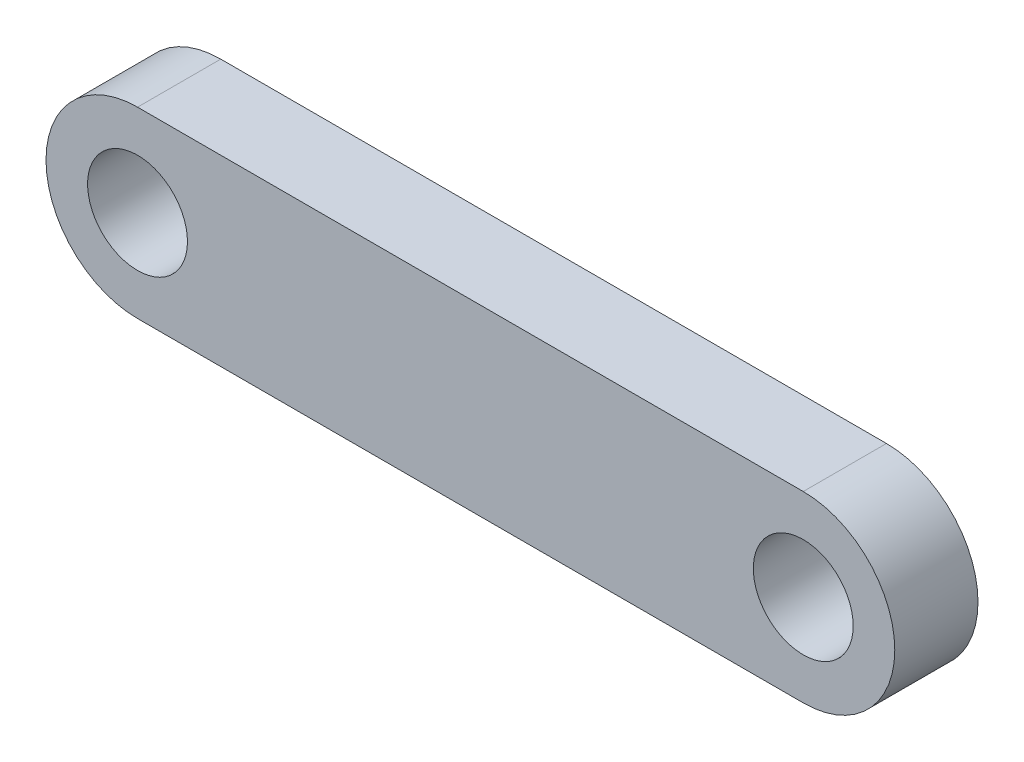
ISO-10303-21;
HEADER;
FILE_DESCRIPTION(('STEP AP214'),'2;1');
FILE_NAME('part.step','',(''),(''),'','','');
FILE_SCHEMA(('AUTOMOTIVE_DESIGN { 1 0 10303 214 1 1 1 1 }'));
ENDSEC;
DATA;
#1=APPLICATION_CONTEXT('core data for automotive mechanical design processes');
#2=APPLICATION_PROTOCOL_DEFINITION('international standard','automotive_design',2000,#1);
#3=PRODUCT_CONTEXT('',#1,'mechanical');
#4=PRODUCT('Part','Part','',(#3));
#5=PRODUCT_RELATED_PRODUCT_CATEGORY('part','',(#4));
#6=PRODUCT_DEFINITION_FORMATION('','',#4);
#7=PRODUCT_DEFINITION_CONTEXT('part definition',#1,'design');
#8=PRODUCT_DEFINITION('design','',#6,#7);
#9=PRODUCT_DEFINITION_SHAPE('','',#8);
#10=(LENGTH_UNIT() NAMED_UNIT(*) SI_UNIT(.MILLI.,.METRE.));
#11=(NAMED_UNIT(*) PLANE_ANGLE_UNIT() SI_UNIT($,.RADIAN.));
#12=(NAMED_UNIT(*) SI_UNIT($,.STERADIAN.) SOLID_ANGLE_UNIT());
#13=UNCERTAINTY_MEASURE_WITH_UNIT(LENGTH_MEASURE(1.E-05),#10,'distance_accuracy_value','');
#14=(GEOMETRIC_REPRESENTATION_CONTEXT(3) GLOBAL_UNCERTAINTY_ASSIGNED_CONTEXT((#13)) GLOBAL_UNIT_ASSIGNED_CONTEXT((#10,
#11,#12)) REPRESENTATION_CONTEXT('',''));
#15=CARTESIAN_POINT('',(0.,0.,0.));
#16=DIRECTION('',(0.,0.,1.));
#17=DIRECTION('',(1.,0.,0.));
#18=AXIS2_PLACEMENT_3D('',#15,#16,#17);
#19=CARTESIAN_POINT('',(-20.,0.,2.5));
#20=DIRECTION('',(0.,0.,1.));
#21=DIRECTION('',(1.,0.,0.));
#22=AXIS2_PLACEMENT_3D('',#19,#20,#21);
#23=PLANE('',#22);
#24=CARTESIAN_POINT('',(-20.,0.,2.5));
#25=DIRECTION('',(0.,0.,1.));
#26=DIRECTION('',(1.,0.,0.));
#27=AXIS2_PLACEMENT_3D('',#24,#25,#26);
#28=CIRCLE('',#27,3.);
#29=CARTESIAN_POINT('',(-17.,0.,2.5));
#30=VERTEX_POINT('',#29);
#31=EDGE_CURVE('E106',#30,#30,#28,.T.);
#32=ORIENTED_EDGE('',*,*,#31,.F.);
#33=EDGE_LOOP('',(#32));
#34=FACE_BOUND('',#33,.T.);
#35=CARTESIAN_POINT('',(-20.,0.,2.5));
#36=DIRECTION('',(0.,0.,1.));
#37=DIRECTION('',(1.,0.,0.));
#38=AXIS2_PLACEMENT_3D('',#35,#36,#37);
#39=CIRCLE('',#38,5.5);
#40=CARTESIAN_POINT('',(-20.,5.5,2.5));
#41=VERTEX_POINT('',#40);
#42=CARTESIAN_POINT('',(-20.,-5.5,2.5));
#43=VERTEX_POINT('',#42);
#44=EDGE_CURVE('E91',#41,#43,#39,.T.);
#45=ORIENTED_EDGE('',*,*,#44,.T.);
#46=DIRECTION('',(1.,0.,0.));
#47=VECTOR('',#46,1.);
#48=CARTESIAN_POINT('',(-20.,-5.5,2.5));
#49=LINE('',#48,#47);
#50=CARTESIAN_POINT('',(20.,-5.5,2.5));
#51=VERTEX_POINT('',#50);
#52=EDGE_CURVE('E86',#43,#51,#49,.T.);
#53=ORIENTED_EDGE('',*,*,#52,.T.);
#54=CARTESIAN_POINT('',(20.,0.,2.5));
#55=DIRECTION('',(0.,0.,1.));
#56=DIRECTION('',(1.,0.,0.));
#57=AXIS2_PLACEMENT_3D('',#54,#55,#56);
#58=CIRCLE('',#57,5.5);
#59=CARTESIAN_POINT('',(20.,5.5,2.5));
#60=VERTEX_POINT('',#59);
#61=EDGE_CURVE('E89',#51,#60,#58,.T.);
#62=ORIENTED_EDGE('',*,*,#61,.T.);
#63=DIRECTION('',(-1.,0.,0.));
#64=VECTOR('',#63,1.);
#65=CARTESIAN_POINT('',(-20.,5.5,2.5));
#66=LINE('',#65,#64);
#67=EDGE_CURVE('E56',#60,#41,#66,.T.);
#68=ORIENTED_EDGE('',*,*,#67,.T.);
#69=EDGE_LOOP('',(#45,#53,#62,#68));
#70=FACE_BOUND('',#69,.T.);
#71=CARTESIAN_POINT('',(20.,0.,2.5));
#72=DIRECTION('',(0.,0.,1.));
#73=DIRECTION('',(1.,0.,0.));
#74=AXIS2_PLACEMENT_3D('',#71,#72,#73);
#75=CIRCLE('',#74,3.);
#76=CARTESIAN_POINT('',(23.,0.,2.5));
#77=VERTEX_POINT('',#76);
#78=EDGE_CURVE('E121',#77,#77,#75,.T.);
#79=ORIENTED_EDGE('',*,*,#78,.F.);
#80=EDGE_LOOP('',(#79));
#81=FACE_BOUND('',#80,.T.);
#82=ADVANCED_FACE('F39',(#34,#70,#81),#23,.T.);
#83=CARTESIAN_POINT('',(-20.,0.,-2.5));
#84=DIRECTION('',(0.,0.,1.));
#85=DIRECTION('',(1.,0.,0.));
#86=AXIS2_PLACEMENT_3D('',#83,#84,#85);
#87=PLANE('',#86);
#88=CARTESIAN_POINT('',(-20.,0.,-2.5));
#89=DIRECTION('',(0.,0.,1.));
#90=DIRECTION('',(1.,0.,0.));
#91=AXIS2_PLACEMENT_3D('',#88,#89,#90);
#92=CIRCLE('',#91,5.5);
#93=CARTESIAN_POINT('',(-20.,5.5,-2.5));
#94=VERTEX_POINT('',#93);
#95=CARTESIAN_POINT('',(-20.,-5.5,-2.5));
#96=VERTEX_POINT('',#95);
#97=EDGE_CURVE('E103',#94,#96,#92,.T.);
#98=ORIENTED_EDGE('',*,*,#97,.F.);
#99=DIRECTION('',(-1.,0.,0.));
#100=VECTOR('',#99,1.);
#101=CARTESIAN_POINT('',(-20.,5.5,-2.5));
#102=LINE('',#101,#100);
#103=CARTESIAN_POINT('',(20.,5.5,-2.5));
#104=VERTEX_POINT('',#103);
#105=EDGE_CURVE('E79',#104,#94,#102,.T.);
#106=ORIENTED_EDGE('',*,*,#105,.F.);
#107=CARTESIAN_POINT('',(20.,0.,-2.5));
#108=DIRECTION('',(0.,0.,1.));
#109=DIRECTION('',(1.,0.,0.));
#110=AXIS2_PLACEMENT_3D('',#107,#108,#109);
#111=CIRCLE('',#110,5.5);
#112=CARTESIAN_POINT('',(20.,-5.5,-2.5));
#113=VERTEX_POINT('',#112);
#114=EDGE_CURVE('E73',#113,#104,#111,.T.);
#115=ORIENTED_EDGE('',*,*,#114,.F.);
#116=DIRECTION('',(1.,0.,0.));
#117=VECTOR('',#116,1.);
#118=CARTESIAN_POINT('',(-20.,-5.5,-2.5));
#119=LINE('',#118,#117);
#120=EDGE_CURVE('E95',#96,#113,#119,.T.);
#121=ORIENTED_EDGE('',*,*,#120,.F.);
#122=EDGE_LOOP('',(#98,#106,#115,#121));
#123=FACE_BOUND('',#122,.T.);
#124=CARTESIAN_POINT('',(-20.,0.,-2.5));
#125=DIRECTION('',(0.,0.,1.));
#126=DIRECTION('',(1.,0.,0.));
#127=AXIS2_PLACEMENT_3D('',#124,#125,#126);
#128=CIRCLE('',#127,3.);
#129=CARTESIAN_POINT('',(-17.,0.,-2.5));
#130=VERTEX_POINT('',#129);
#131=EDGE_CURVE('E118',#130,#130,#128,.T.);
#132=ORIENTED_EDGE('',*,*,#131,.T.);
#133=EDGE_LOOP('',(#132));
#134=FACE_BOUND('',#133,.T.);
#135=CARTESIAN_POINT('',(20.,0.,-2.5));
#136=DIRECTION('',(0.,0.,1.));
#137=DIRECTION('',(1.,0.,0.));
#138=AXIS2_PLACEMENT_3D('',#135,#136,#137);
#139=CIRCLE('',#138,3.);
#140=CARTESIAN_POINT('',(23.,0.,-2.5));
#141=VERTEX_POINT('',#140);
#142=EDGE_CURVE('E124',#141,#141,#139,.T.);
#143=ORIENTED_EDGE('',*,*,#142,.T.);
#144=EDGE_LOOP('',(#143));
#145=FACE_BOUND('',#144,.T.);
#146=ADVANCED_FACE('F114',(#123,#134,#145),#87,.F.);
#147=CARTESIAN_POINT('',(-20.,0.,2.5));
#148=DIRECTION('',(0.,0.,-1.));
#149=DIRECTION('',(-1.,0.,0.));
#150=AXIS2_PLACEMENT_3D('',#147,#148,#149);
#151=CYLINDRICAL_SURFACE('',#150,5.5);
#152=ORIENTED_EDGE('',*,*,#97,.T.);
#153=DIRECTION('',(0.,0.,-1.));
#154=VECTOR('',#153,1.);
#155=CARTESIAN_POINT('',(-20.,-5.5,2.5));
#156=LINE('',#155,#154);
#157=EDGE_CURVE('E11',#43,#96,#156,.T.);
#158=ORIENTED_EDGE('',*,*,#157,.F.);
#159=ORIENTED_EDGE('',*,*,#44,.F.);
#160=DIRECTION('',(0.,0.,-1.));
#161=VECTOR('',#160,1.);
#162=CARTESIAN_POINT('',(-20.,5.5,2.5));
#163=LINE('',#162,#161);
#164=EDGE_CURVE('E99',#41,#94,#163,.T.);
#165=ORIENTED_EDGE('',*,*,#164,.T.);
#166=EDGE_LOOP('',(#152,#158,#159,#165));
#167=FACE_BOUND('',#166,.T.);
#168=ADVANCED_FACE('F41',(#167),#151,.T.);
#169=CARTESIAN_POINT('',(-20.,-5.5,2.5));
#170=DIRECTION('',(0.,1.,0.));
#171=DIRECTION('',(0.,0.,1.));
#172=AXIS2_PLACEMENT_3D('',#169,#170,#171);
#173=PLANE('',#172);
#174=ORIENTED_EDGE('',*,*,#120,.T.);
#175=DIRECTION('',(0.,0.,-1.));
#176=VECTOR('',#175,1.);
#177=CARTESIAN_POINT('',(20.,-5.5,2.5));
#178=LINE('',#177,#176);
#179=EDGE_CURVE('E48',#51,#113,#178,.T.);
#180=ORIENTED_EDGE('',*,*,#179,.F.);
#181=ORIENTED_EDGE('',*,*,#52,.F.);
#182=ORIENTED_EDGE('',*,*,#157,.T.);
#183=EDGE_LOOP('',(#174,#180,#181,#182));
#184=FACE_BOUND('',#183,.T.);
#185=ADVANCED_FACE('F94',(#184),#173,.F.);
#186=CARTESIAN_POINT('',(20.,0.,2.5));
#187=DIRECTION('',(0.,0.,-1.));
#188=DIRECTION('',(-1.,0.,0.));
#189=AXIS2_PLACEMENT_3D('',#186,#187,#188);
#190=CYLINDRICAL_SURFACE('',#189,5.5);
#191=ORIENTED_EDGE('',*,*,#114,.T.);
#192=DIRECTION('',(0.,0.,-1.));
#193=VECTOR('',#192,1.);
#194=CARTESIAN_POINT('',(20.,5.5,2.5));
#195=LINE('',#194,#193);
#196=EDGE_CURVE('E96',#60,#104,#195,.T.);
#197=ORIENTED_EDGE('',*,*,#196,.F.);
#198=ORIENTED_EDGE('',*,*,#61,.F.);
#199=ORIENTED_EDGE('',*,*,#179,.T.);
#200=EDGE_LOOP('',(#191,#197,#198,#199));
#201=FACE_BOUND('',#200,.T.);
#202=ADVANCED_FACE('F97',(#201),#190,.T.);
#203=CARTESIAN_POINT('',(-20.,5.5,2.5));
#204=DIRECTION('',(0.,-1.,0.));
#205=DIRECTION('',(0.,0.,-1.));
#206=AXIS2_PLACEMENT_3D('',#203,#204,#205);
#207=PLANE('',#206);
#208=ORIENTED_EDGE('',*,*,#105,.T.);
#209=ORIENTED_EDGE('',*,*,#164,.F.);
#210=ORIENTED_EDGE('',*,*,#67,.F.);
#211=ORIENTED_EDGE('',*,*,#196,.T.);
#212=EDGE_LOOP('',(#208,#209,#210,#211));
#213=FACE_BOUND('',#212,.T.);
#214=ADVANCED_FACE('F111',(#213),#207,.F.);
#215=CARTESIAN_POINT('',(-20.,0.,2.5));
#216=DIRECTION('',(0.,0.,-1.));
#217=DIRECTION('',(-1.,0.,0.));
#218=AXIS2_PLACEMENT_3D('',#215,#216,#217);
#219=CYLINDRICAL_SURFACE('',#218,3.);
#220=ORIENTED_EDGE('',*,*,#31,.T.);
#221=EDGE_LOOP('',(#220));
#222=FACE_BOUND('',#221,.T.);
#223=ORIENTED_EDGE('',*,*,#131,.F.);
#224=EDGE_LOOP('',(#223));
#225=FACE_BOUND('',#224,.T.);
#226=ADVANCED_FACE('F141',(#222,#225),#219,.F.);
#227=CARTESIAN_POINT('',(20.,0.,2.5));
#228=DIRECTION('',(0.,0.,-1.));
#229=DIRECTION('',(-1.,0.,0.));
#230=AXIS2_PLACEMENT_3D('',#227,#228,#229);
#231=CYLINDRICAL_SURFACE('',#230,3.);
#232=ORIENTED_EDGE('',*,*,#78,.T.);
#233=EDGE_LOOP('',(#232));
#234=FACE_BOUND('',#233,.T.);
#235=ORIENTED_EDGE('',*,*,#142,.F.);
#236=EDGE_LOOP('',(#235));
#237=FACE_BOUND('',#236,.T.);
#238=ADVANCED_FACE('F130',(#234,#237),#231,.F.);
#239=CLOSED_SHELL('',(#82,#146,#168,#185,#202,#214,#226,#238));
#240=MANIFOLD_SOLID_BREP('B2',#239);
#241=ADVANCED_BREP_SHAPE_REPRESENTATION('',(#18,#240),#14);
#242=SHAPE_DEFINITION_REPRESENTATION(#9,#241);
ENDSEC;
END-ISO-10303-21;
